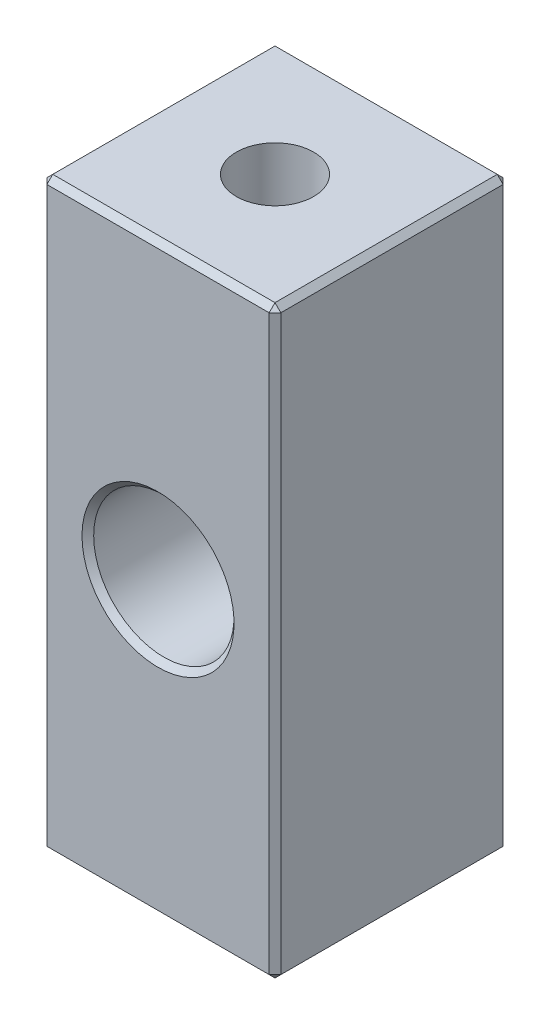
ISO-10303-21;
HEADER;
FILE_DESCRIPTION(('STEP AP214'),'2;1');
FILE_NAME('part.step','',(''),(''),'','','');
FILE_SCHEMA(('AUTOMOTIVE_DESIGN { 1 0 10303 214 1 1 1 1 }'));
ENDSEC;
DATA;
#1=APPLICATION_CONTEXT('core data for automotive mechanical design processes');
#2=APPLICATION_PROTOCOL_DEFINITION('international standard','automotive_design',2000,#1);
#3=PRODUCT_CONTEXT('',#1,'mechanical');
#4=PRODUCT('Part','Part','',(#3));
#5=PRODUCT_RELATED_PRODUCT_CATEGORY('part','',(#4));
#6=PRODUCT_DEFINITION_FORMATION('','',#4);
#7=PRODUCT_DEFINITION_CONTEXT('part definition',#1,'design');
#8=PRODUCT_DEFINITION('design','',#6,#7);
#9=PRODUCT_DEFINITION_SHAPE('','',#8);
#10=(LENGTH_UNIT() NAMED_UNIT(*) SI_UNIT(.MILLI.,.METRE.));
#11=(NAMED_UNIT(*) PLANE_ANGLE_UNIT() SI_UNIT($,.RADIAN.));
#12=(NAMED_UNIT(*) SI_UNIT($,.STERADIAN.) SOLID_ANGLE_UNIT());
#13=UNCERTAINTY_MEASURE_WITH_UNIT(LENGTH_MEASURE(1.E-05),#10,'distance_accuracy_value','');
#14=(GEOMETRIC_REPRESENTATION_CONTEXT(3) GLOBAL_UNCERTAINTY_ASSIGNED_CONTEXT((#13)) GLOBAL_UNIT_ASSIGNED_CONTEXT((#10,
#11,#12)) REPRESENTATION_CONTEXT('',''));
#15=CARTESIAN_POINT('',(0.,0.,0.));
#16=DIRECTION('',(0.,0.,1.));
#17=DIRECTION('',(1.,0.,0.));
#18=AXIS2_PLACEMENT_3D('',#15,#16,#17);
#19=CARTESIAN_POINT('',(-5.,-12.5,10.));
#20=DIRECTION('',(1.,0.,0.));
#21=DIRECTION('',(0.,0.,-1.));
#22=AXIS2_PLACEMENT_3D('',#19,#20,#21);
#23=PLANE('',#22);
#24=DIRECTION('',(0.,0.,-1.));
#25=VECTOR('',#24,1.);
#26=CARTESIAN_POINT('',(-5.,12.25,10.));
#27=LINE('',#26,#25);
#28=CARTESIAN_POINT('',(-5.,12.25,9.75));
#29=VERTEX_POINT('',#28);
#30=CARTESIAN_POINT('',(-5.,12.25,0.25));
#31=VERTEX_POINT('',#30);
#32=EDGE_CURVE('E169',#29,#31,#27,.T.);
#33=ORIENTED_EDGE('',*,*,#32,.T.);
#34=DIRECTION('',(0.,-1.,0.));
#35=VECTOR('',#34,1.);
#36=CARTESIAN_POINT('',(-5.,-12.5,0.25));
#37=LINE('',#36,#35);
#38=CARTESIAN_POINT('',(-5.,-12.25,0.25));
#39=VERTEX_POINT('',#38);
#40=EDGE_CURVE('E172',#31,#39,#37,.T.);
#41=ORIENTED_EDGE('',*,*,#40,.T.);
#42=DIRECTION('',(0.,0.,1.));
#43=VECTOR('',#42,1.);
#44=CARTESIAN_POINT('',(-5.,-12.25,10.));
#45=LINE('',#44,#43);
#46=CARTESIAN_POINT('',(-5.,-12.25,9.75));
#47=VERTEX_POINT('',#46);
#48=EDGE_CURVE('E167',#39,#47,#45,.T.);
#49=ORIENTED_EDGE('',*,*,#48,.T.);
#50=DIRECTION('',(0.,1.,0.));
#51=VECTOR('',#50,1.);
#52=CARTESIAN_POINT('',(-5.,-12.5,9.75));
#53=LINE('',#52,#51);
#54=EDGE_CURVE('E165',#47,#29,#53,.T.);
#55=ORIENTED_EDGE('',*,*,#54,.T.);
#56=EDGE_LOOP('',(#33,#41,#49,#55));
#57=FACE_BOUND('',#56,.T.);
#58=ADVANCED_FACE('F31',(#57),#23,.F.);
#59=CARTESIAN_POINT('',(-5.,-12.5,10.));
#60=DIRECTION('',(0.,1.,0.));
#61=DIRECTION('',(0.,0.,1.));
#62=AXIS2_PLACEMENT_3D('',#59,#60,#61);
#63=PLANE('',#62);
#64=DIRECTION('',(-1.,0.,0.));
#65=VECTOR('',#64,1.);
#66=CARTESIAN_POINT('',(-5.,-12.5,9.75));
#67=LINE('',#66,#65);
#68=CARTESIAN_POINT('',(4.75,-12.5,9.75));
#69=VERTEX_POINT('',#68);
#70=CARTESIAN_POINT('',(-4.75,-12.5,9.75));
#71=VERTEX_POINT('',#70);
#72=EDGE_CURVE('E183',#69,#71,#67,.T.);
#73=ORIENTED_EDGE('',*,*,#72,.T.);
#74=DIRECTION('',(0.,0.,-1.));
#75=VECTOR('',#74,1.);
#76=CARTESIAN_POINT('',(-4.75,-12.5,10.));
#77=LINE('',#76,#75);
#78=CARTESIAN_POINT('',(-4.75,-12.5,0.249999999999997));
#79=VERTEX_POINT('',#78);
#80=EDGE_CURVE('E189',#71,#79,#77,.T.);
#81=ORIENTED_EDGE('',*,*,#80,.T.);
#82=DIRECTION('',(1.,0.,0.));
#83=VECTOR('',#82,1.);
#84=CARTESIAN_POINT('',(5.,-12.5,0.249999999999997));
#85=LINE('',#84,#83);
#86=CARTESIAN_POINT('',(4.75,-12.5,0.249999999999997));
#87=VERTEX_POINT('',#86);
#88=EDGE_CURVE('E187',#79,#87,#85,.T.);
#89=ORIENTED_EDGE('',*,*,#88,.T.);
#90=DIRECTION('',(0.,0.,1.));
#91=VECTOR('',#90,1.);
#92=CARTESIAN_POINT('',(4.75,-12.5,10.));
#93=LINE('',#92,#91);
#94=EDGE_CURVE('E185',#87,#69,#93,.T.);
#95=ORIENTED_EDGE('',*,*,#94,.T.);
#96=EDGE_LOOP('',(#73,#81,#89,#95));
#97=FACE_BOUND('',#96,.T.);
#98=CARTESIAN_POINT('',(0.,-12.5,5.));
#99=DIRECTION('',(0.,-1.,0.));
#100=DIRECTION('',(0.,0.,-1.));
#101=AXIS2_PLACEMENT_3D('',#98,#99,#100);
#102=CIRCLE('',#101,1.64999999999999);
#103=CARTESIAN_POINT('',(0.,-12.5,3.35000000000001));
#104=VERTEX_POINT('',#103);
#105=EDGE_CURVE('E144',#104,#104,#102,.T.);
#106=ORIENTED_EDGE('',*,*,#105,.F.);
#107=EDGE_LOOP('',(#106));
#108=FACE_BOUND('',#107,.T.);
#109=ADVANCED_FACE('F317',(#97,#108),#63,.F.);
#110=CARTESIAN_POINT('',(5.,-12.5,10.));
#111=DIRECTION('',(-1.,0.,0.));
#112=DIRECTION('',(0.,0.,1.));
#113=AXIS2_PLACEMENT_3D('',#110,#111,#112);
#114=PLANE('',#113);
#115=DIRECTION('',(0.,-1.,0.));
#116=VECTOR('',#115,1.);
#117=CARTESIAN_POINT('',(5.,-12.5,9.75));
#118=LINE('',#117,#116);
#119=CARTESIAN_POINT('',(5.,12.25,9.75));
#120=VERTEX_POINT('',#119);
#121=CARTESIAN_POINT('',(5.,-12.25,9.75));
#122=VERTEX_POINT('',#121);
#123=EDGE_CURVE('E192',#120,#122,#118,.T.);
#124=ORIENTED_EDGE('',*,*,#123,.T.);
#125=DIRECTION('',(0.,0.,-1.));
#126=VECTOR('',#125,1.);
#127=CARTESIAN_POINT('',(5.,-12.25,10.));
#128=LINE('',#127,#126);
#129=CARTESIAN_POINT('',(5.,-12.25,0.249999999999997));
#130=VERTEX_POINT('',#129);
#131=EDGE_CURVE('E198',#122,#130,#128,.T.);
#132=ORIENTED_EDGE('',*,*,#131,.T.);
#133=DIRECTION('',(0.,1.,0.));
#134=VECTOR('',#133,1.);
#135=CARTESIAN_POINT('',(5.,12.5,0.249999999999997));
#136=LINE('',#135,#134);
#137=CARTESIAN_POINT('',(5.,12.25,0.249999999999997));
#138=VERTEX_POINT('',#137);
#139=EDGE_CURVE('E196',#130,#138,#136,.T.);
#140=ORIENTED_EDGE('',*,*,#139,.T.);
#141=DIRECTION('',(0.,0.,1.));
#142=VECTOR('',#141,1.);
#143=CARTESIAN_POINT('',(5.,12.25,10.));
#144=LINE('',#143,#142);
#145=EDGE_CURVE('E194',#138,#120,#144,.T.);
#146=ORIENTED_EDGE('',*,*,#145,.T.);
#147=EDGE_LOOP('',(#124,#132,#140,#146));
#148=FACE_BOUND('',#147,.T.);
#149=ADVANCED_FACE('F291',(#148),#114,.F.);
#150=CARTESIAN_POINT('',(-5.,12.5,10.));
#151=DIRECTION('',(0.,-1.,0.));
#152=DIRECTION('',(0.,0.,-1.));
#153=AXIS2_PLACEMENT_3D('',#150,#151,#152);
#154=PLANE('',#153);
#155=DIRECTION('',(-1.,0.,0.));
#156=VECTOR('',#155,1.);
#157=CARTESIAN_POINT('',(-5.,12.5,0.249999999999997));
#158=LINE('',#157,#156);
#159=CARTESIAN_POINT('',(4.75,12.5,0.249999999999997));
#160=VERTEX_POINT('',#159);
#161=CARTESIAN_POINT('',(-4.75,12.5,0.249999999999997));
#162=VERTEX_POINT('',#161);
#163=EDGE_CURVE('E178',#160,#162,#158,.T.);
#164=ORIENTED_EDGE('',*,*,#163,.T.);
#165=DIRECTION('',(0.,0.,1.));
#166=VECTOR('',#165,1.);
#167=CARTESIAN_POINT('',(-4.75,12.5,10.));
#168=LINE('',#167,#166);
#169=CARTESIAN_POINT('',(-4.75,12.5,9.75));
#170=VERTEX_POINT('',#169);
#171=EDGE_CURVE('E180',#162,#170,#168,.T.);
#172=ORIENTED_EDGE('',*,*,#171,.T.);
#173=DIRECTION('',(1.,0.,0.));
#174=VECTOR('',#173,1.);
#175=CARTESIAN_POINT('',(-5.,12.5,9.75));
#176=LINE('',#175,#174);
#177=CARTESIAN_POINT('',(4.75,12.5,9.75));
#178=VERTEX_POINT('',#177);
#179=EDGE_CURVE('E174',#170,#178,#176,.T.);
#180=ORIENTED_EDGE('',*,*,#179,.T.);
#181=DIRECTION('',(0.,0.,-1.));
#182=VECTOR('',#181,1.);
#183=CARTESIAN_POINT('',(4.75,12.5,10.));
#184=LINE('',#183,#182);
#185=EDGE_CURVE('E176',#178,#160,#184,.T.);
#186=ORIENTED_EDGE('',*,*,#185,.T.);
#187=EDGE_LOOP('',(#164,#172,#180,#186));
#188=FACE_BOUND('',#187,.T.);
#189=CARTESIAN_POINT('',(0.,12.5,5.));
#190=DIRECTION('',(0.,1.,0.));
#191=DIRECTION('',(0.,0.,1.));
#192=AXIS2_PLACEMENT_3D('',#189,#190,#191);
#193=CIRCLE('',#192,1.64999999999999);
#194=CARTESIAN_POINT('',(0.,12.5,6.64999999999999));
#195=VERTEX_POINT('',#194);
#196=EDGE_CURVE('E134',#195,#195,#193,.T.);
#197=ORIENTED_EDGE('',*,*,#196,.F.);
#198=EDGE_LOOP('',(#197));
#199=FACE_BOUND('',#198,.T.);
#200=ADVANCED_FACE('F345',(#188,#199),#154,.F.);
#201=CARTESIAN_POINT('',(-5.,12.5,10.));
#202=DIRECTION('',(0.,0.,-1.));
#203=DIRECTION('',(-1.,0.,0.));
#204=AXIS2_PLACEMENT_3D('',#201,#202,#203);
#205=PLANE('',#204);
#206=DIRECTION('',(0.,1.,0.));
#207=VECTOR('',#206,1.);
#208=CARTESIAN_POINT('',(4.75,12.5,10.));
#209=LINE('',#208,#207);
#210=CARTESIAN_POINT('',(4.75,-12.25,10.));
#211=VERTEX_POINT('',#210);
#212=CARTESIAN_POINT('',(4.75,12.25,10.));
#213=VERTEX_POINT('',#212);
#214=EDGE_CURVE('E40',#211,#213,#209,.T.);
#215=ORIENTED_EDGE('',*,*,#214,.T.);
#216=DIRECTION('',(-1.,0.,0.));
#217=VECTOR('',#216,1.);
#218=CARTESIAN_POINT('',(-5.,12.25,10.));
#219=LINE('',#218,#217);
#220=CARTESIAN_POINT('',(-4.75,12.25,10.));
#221=VERTEX_POINT('',#220);
#222=EDGE_CURVE('E11',#213,#221,#219,.T.);
#223=ORIENTED_EDGE('',*,*,#222,.T.);
#224=DIRECTION('',(0.,-1.,0.));
#225=VECTOR('',#224,1.);
#226=CARTESIAN_POINT('',(-4.75,12.5,10.));
#227=LINE('',#226,#225);
#228=CARTESIAN_POINT('',(-4.75,-12.25,10.));
#229=VERTEX_POINT('',#228);
#230=EDGE_CURVE('E204',#221,#229,#227,.T.);
#231=ORIENTED_EDGE('',*,*,#230,.T.);
#232=DIRECTION('',(1.,0.,0.));
#233=VECTOR('',#232,1.);
#234=CARTESIAN_POINT('',(-5.,-12.25,10.));
#235=LINE('',#234,#233);
#236=EDGE_CURVE('E51',#229,#211,#235,.T.);
#237=ORIENTED_EDGE('',*,*,#236,.T.);
#238=EDGE_LOOP('',(#215,#223,#231,#237));
#239=FACE_BOUND('',#238,.T.);
#240=CARTESIAN_POINT('',(0.,0.,10.));
#241=DIRECTION('',(0.,0.,-1.));
#242=DIRECTION('',(-1.,0.,0.));
#243=AXIS2_PLACEMENT_3D('',#240,#241,#242);
#244=CIRCLE('',#243,3.25);
#245=CARTESIAN_POINT('',(-3.25,0.,10.));
#246=VERTEX_POINT('',#245);
#247=EDGE_CURVE('E201',#246,#246,#244,.T.);
#248=ORIENTED_EDGE('',*,*,#247,.T.);
#249=EDGE_LOOP('',(#248));
#250=FACE_BOUND('',#249,.T.);
#251=ADVANCED_FACE('F352',(#239,#250),#205,.F.);
#252=CARTESIAN_POINT('',(-5.,12.5,0.));
#253=DIRECTION('',(0.,0.,-1.));
#254=DIRECTION('',(-1.,0.,0.));
#255=AXIS2_PLACEMENT_3D('',#252,#253,#254);
#256=PLANE('',#255);
#257=CARTESIAN_POINT('',(0.,0.,0.));
#258=DIRECTION('',(0.,0.,-1.));
#259=DIRECTION('',(-1.,0.,0.));
#260=AXIS2_PLACEMENT_3D('',#257,#258,#259);
#261=CIRCLE('',#260,3.25);
#262=CARTESIAN_POINT('',(-3.25,0.,0.));
#263=VERTEX_POINT('',#262);
#264=EDGE_CURVE('E156',#263,#263,#261,.F.);
#265=ORIENTED_EDGE('',*,*,#264,.T.);
#266=EDGE_LOOP('',(#265));
#267=FACE_BOUND('',#266,.T.);
#268=DIRECTION('',(0.,-1.,0.));
#269=VECTOR('',#268,1.);
#270=CARTESIAN_POINT('',(4.75,-12.5,0.));
#271=LINE('',#270,#269);
#272=CARTESIAN_POINT('',(4.75,12.25,0.));
#273=VERTEX_POINT('',#272);
#274=CARTESIAN_POINT('',(4.75,-12.25,0.));
#275=VERTEX_POINT('',#274);
#276=EDGE_CURVE('E147',#273,#275,#271,.T.);
#277=ORIENTED_EDGE('',*,*,#276,.T.);
#278=DIRECTION('',(-1.,0.,0.));
#279=VECTOR('',#278,1.);
#280=CARTESIAN_POINT('',(-5.,-12.25,0.));
#281=LINE('',#280,#279);
#282=CARTESIAN_POINT('',(-4.75,-12.25,0.));
#283=VERTEX_POINT('',#282);
#284=EDGE_CURVE('E153',#275,#283,#281,.T.);
#285=ORIENTED_EDGE('',*,*,#284,.T.);
#286=DIRECTION('',(0.,1.,0.));
#287=VECTOR('',#286,1.);
#288=CARTESIAN_POINT('',(-4.75,12.5,0.));
#289=LINE('',#288,#287);
#290=CARTESIAN_POINT('',(-4.75,12.25,0.));
#291=VERTEX_POINT('',#290);
#292=EDGE_CURVE('E151',#283,#291,#289,.T.);
#293=ORIENTED_EDGE('',*,*,#292,.T.);
#294=DIRECTION('',(1.,0.,0.));
#295=VECTOR('',#294,1.);
#296=CARTESIAN_POINT('',(5.,12.25,0.));
#297=LINE('',#296,#295);
#298=EDGE_CURVE('E149',#291,#273,#297,.T.);
#299=ORIENTED_EDGE('',*,*,#298,.T.);
#300=EDGE_LOOP('',(#277,#285,#293,#299));
#301=FACE_BOUND('',#300,.T.);
#302=ADVANCED_FACE('F283',(#267,#301),#256,.T.);
#303=CARTESIAN_POINT('',(0.,0.,0.));
#304=DIRECTION('',(0.,0.,1.));
#305=DIRECTION('',(1.,0.,0.));
#306=AXIS2_PLACEMENT_3D('',#303,#304,#305);
#307=CYLINDRICAL_SURFACE('',#306,3.);
#308=CARTESIAN_POINT('',(0.,0.,0.250000000000002));
#309=DIRECTION('',(0.,0.,-1.));
#310=DIRECTION('',(-1.,0.,0.));
#311=AXIS2_PLACEMENT_3D('',#308,#309,#310);
#312=CIRCLE('',#311,3.);
#313=CARTESIAN_POINT('',(-3.,0.,0.250000000000002));
#314=VERTEX_POINT('',#313);
#315=EDGE_CURVE('E162',#314,#314,#312,.T.);
#316=ORIENTED_EDGE('',*,*,#315,.T.);
#317=EDGE_LOOP('',(#316));
#318=FACE_BOUND('',#317,.T.);
#319=CARTESIAN_POINT('',(0.,0.,9.75));
#320=DIRECTION('',(0.,0.,-1.));
#321=DIRECTION('',(-1.,0.,0.));
#322=AXIS2_PLACEMENT_3D('',#319,#320,#321);
#323=CIRCLE('',#322,3.);
#324=CARTESIAN_POINT('',(-3.,0.,9.75));
#325=VERTEX_POINT('',#324);
#326=EDGE_CURVE('E159',#325,#325,#323,.F.);
#327=ORIENTED_EDGE('',*,*,#326,.T.);
#328=EDGE_LOOP('',(#327));
#329=FACE_BOUND('',#328,.T.);
#330=ADVANCED_FACE('F577',(#318,#329),#307,.F.);
#331=CARTESIAN_POINT('',(0.,-12.5,5.));
#332=DIRECTION('',(0.,-1.,0.));
#333=DIRECTION('',(0.,0.,-1.));
#334=AXIS2_PLACEMENT_3D('',#331,#332,#333);
#335=CYLINDRICAL_SURFACE('',#334,1.64999999999999);
#336=CARTESIAN_POINT('',(0.,-4.5,5.));
#337=DIRECTION('',(0.,-1.,0.));
#338=DIRECTION('',(0.,0.,-1.));
#339=AXIS2_PLACEMENT_3D('',#336,#337,#338);
#340=CIRCLE('',#339,1.65);
#341=CARTESIAN_POINT('',(0.,-4.5,3.35));
#342=VERTEX_POINT('',#341);
#343=EDGE_CURVE('E137',#342,#342,#340,.T.);
#344=ORIENTED_EDGE('',*,*,#343,.F.);
#345=EDGE_LOOP('',(#344));
#346=FACE_BOUND('',#345,.T.);
#347=ORIENTED_EDGE('',*,*,#105,.T.);
#348=EDGE_LOOP('',(#347));
#349=FACE_BOUND('',#348,.T.);
#350=ADVANCED_FACE('F568',(#346,#349),#335,.F.);
#351=CARTESIAN_POINT('',(0.,-4.5,5.));
#352=DIRECTION('',(0.,-1.,0.));
#353=DIRECTION('',(0.,0.,-1.));
#354=AXIS2_PLACEMENT_3D('',#351,#352,#353);
#355=CONICAL_SURFACE('',#354,1.65,1.02974425867665);
#356=CARTESIAN_POINT('',(0.,-3.50857997860453,5.));
#357=VERTEX_POINT('',#356);
#358=VERTEX_LOOP('',#357);
#359=FACE_BOUND('',#358,.T.);
#360=ORIENTED_EDGE('',*,*,#343,.T.);
#361=EDGE_LOOP('',(#360));
#362=FACE_BOUND('',#361,.T.);
#363=ADVANCED_FACE('F560',(#359,#362),#355,.F.);
#364=CARTESIAN_POINT('',(0.,12.5,5.));
#365=DIRECTION('',(0.,1.,0.));
#366=DIRECTION('',(0.,0.,1.));
#367=AXIS2_PLACEMENT_3D('',#364,#365,#366);
#368=CYLINDRICAL_SURFACE('',#367,1.64999999999999);
#369=CARTESIAN_POINT('',(0.,4.5,5.));
#370=DIRECTION('',(0.,1.,0.));
#371=DIRECTION('',(0.,0.,1.));
#372=AXIS2_PLACEMENT_3D('',#369,#370,#371);
#373=CIRCLE('',#372,1.65);
#374=CARTESIAN_POINT('',(0.,4.5,6.65));
#375=VERTEX_POINT('',#374);
#376=EDGE_CURVE('E132',#375,#375,#373,.T.);
#377=ORIENTED_EDGE('',*,*,#376,.F.);
#378=EDGE_LOOP('',(#377));
#379=FACE_BOUND('',#378,.T.);
#380=ORIENTED_EDGE('',*,*,#196,.T.);
#381=EDGE_LOOP('',(#380));
#382=FACE_BOUND('',#381,.T.);
#383=ADVANCED_FACE('F128',(#379,#382),#368,.F.);
#384=CARTESIAN_POINT('',(0.,4.5,5.));
#385=DIRECTION('',(0.,1.,0.));
#386=DIRECTION('',(0.,0.,1.));
#387=AXIS2_PLACEMENT_3D('',#384,#385,#386);
#388=CONICAL_SURFACE('',#387,1.65,1.02974425867665);
#389=CARTESIAN_POINT('',(0.,3.50857997860453,5.));
#390=VERTEX_POINT('',#389);
#391=VERTEX_LOOP('',#390);
#392=FACE_BOUND('',#391,.T.);
#393=ORIENTED_EDGE('',*,*,#376,.T.);
#394=EDGE_LOOP('',(#393));
#395=FACE_BOUND('',#394,.T.);
#396=ADVANCED_FACE('F124',(#392,#395),#388,.F.);
#397=CARTESIAN_POINT('',(0.,0.,0.));
#398=DIRECTION('',(0.,0.,-1.));
#399=DIRECTION('',(-1.,0.,0.));
#400=AXIS2_PLACEMENT_3D('',#397,#398,#399);
#401=CONICAL_SURFACE('',#400,3.25,0.785398163397448);
#402=ORIENTED_EDGE('',*,*,#315,.F.);
#403=EDGE_LOOP('',(#402));
#404=FACE_BOUND('',#403,.T.);
#405=ORIENTED_EDGE('',*,*,#264,.F.);
#406=EDGE_LOOP('',(#405));
#407=FACE_BOUND('',#406,.T.);
#408=ADVANCED_FACE('F127',(#404,#407),#401,.F.);
#409=CARTESIAN_POINT('',(5.,-12.25,10.));
#410=DIRECTION('',(-0.707106781186543,0.707106781186552,0.));
#411=DIRECTION('',(-0.707106781186552,-0.707106781186543,0.));
#412=AXIS2_PLACEMENT_3D('',#409,#410,#411);
#413=PLANE('',#412);
#414=DIRECTION('',(-0.707106781186552,-0.707106781186543,0.));
#415=VECTOR('',#414,1.);
#416=CARTESIAN_POINT('',(4.75,-12.5,9.75));
#417=LINE('',#416,#415);
#418=EDGE_CURVE('E35',#69,#122,#417,.F.);
#419=ORIENTED_EDGE('',*,*,#418,.F.);
#420=ORIENTED_EDGE('',*,*,#94,.F.);
#421=DIRECTION('',(0.707106781186552,0.707106781186543,0.));
#422=VECTOR('',#421,1.);
#423=CARTESIAN_POINT('',(4.75,-12.5,0.249999999999997));
#424=LINE('',#423,#422);
#425=EDGE_CURVE('E140',#130,#87,#424,.F.);
#426=ORIENTED_EDGE('',*,*,#425,.F.);
#427=ORIENTED_EDGE('',*,*,#131,.F.);
#428=EDGE_LOOP('',(#419,#420,#426,#427));
#429=FACE_BOUND('',#428,.T.);
#430=ADVANCED_FACE('F307',(#429),#413,.F.);
#431=CARTESIAN_POINT('',(4.75,-12.5,9.75));
#432=DIRECTION('',(0.577350269189626,-0.577350269189634,0.577350269189618));
#433=DIRECTION('',(0.707106781186552,0.707106781186543,0.));
#434=AXIS2_PLACEMENT_3D('',#431,#432,#433);
#435=PLANE('',#434);
#436=DIRECTION('',(0.,0.707106781186543,0.707106781186552));
#437=VECTOR('',#436,1.);
#438=CARTESIAN_POINT('',(4.75,-12.5,9.75));
#439=LINE('',#438,#437);
#440=EDGE_CURVE('E264',#69,#211,#439,.T.);
#441=ORIENTED_EDGE('',*,*,#440,.F.);
#442=ORIENTED_EDGE('',*,*,#418,.T.);
#443=DIRECTION('',(0.707106781186543,0.,-0.707106781186552));
#444=VECTOR('',#443,1.);
#445=CARTESIAN_POINT('',(4.875,-12.25,9.875));
#446=LINE('',#445,#444);
#447=EDGE_CURVE('E266',#211,#122,#446,.T.);
#448=ORIENTED_EDGE('',*,*,#447,.F.);
#449=EDGE_LOOP('',(#441,#442,#448));
#450=FACE_BOUND('',#449,.T.);
#451=ADVANCED_FACE('F310',(#450),#435,.T.);
#452=CARTESIAN_POINT('',(4.75,-12.5,0.249999999999997));
#453=DIRECTION('',(0.577350269189618,-0.577350269189626,-0.577350269189634));
#454=DIRECTION('',(0.,0.707106781186552,-0.707106781186543));
#455=AXIS2_PLACEMENT_3D('',#452,#453,#454);
#456=PLANE('',#455);
#457=DIRECTION('',(0.707106781186552,0.,0.707106781186543));
#458=VECTOR('',#457,1.);
#459=CARTESIAN_POINT('',(4.875,-12.25,0.124999999999998));
#460=LINE('',#459,#458);
#461=EDGE_CURVE('E258',#130,#275,#460,.F.);
#462=ORIENTED_EDGE('',*,*,#461,.F.);
#463=ORIENTED_EDGE('',*,*,#425,.T.);
#464=DIRECTION('',(0.,0.707106781186552,-0.707106781186543));
#465=VECTOR('',#464,1.);
#466=CARTESIAN_POINT('',(4.75,-12.5,0.249999999999997));
#467=LINE('',#466,#465);
#468=EDGE_CURVE('E261',#275,#87,#467,.F.);
#469=ORIENTED_EDGE('',*,*,#468,.F.);
#470=EDGE_LOOP('',(#462,#463,#469));
#471=FACE_BOUND('',#470,.T.);
#472=ADVANCED_FACE('F273',(#471),#456,.T.);
#473=CARTESIAN_POINT('',(4.75,12.5,10.));
#474=DIRECTION('',(-0.707106781186552,0.,-0.707106781186543));
#475=DIRECTION('',(-0.707106781186543,0.,0.707106781186552));
#476=AXIS2_PLACEMENT_3D('',#473,#474,#475);
#477=PLANE('',#476);
#478=ORIENTED_EDGE('',*,*,#447,.T.);
#479=ORIENTED_EDGE('',*,*,#123,.F.);
#480=DIRECTION('',(-0.707106781186543,0.,0.707106781186552));
#481=VECTOR('',#480,1.);
#482=CARTESIAN_POINT('',(5.,12.25,9.75));
#483=LINE('',#482,#481);
#484=EDGE_CURVE('E252',#213,#120,#483,.F.);
#485=ORIENTED_EDGE('',*,*,#484,.F.);
#486=ORIENTED_EDGE('',*,*,#214,.F.);
#487=EDGE_LOOP('',(#478,#479,#485,#486));
#488=FACE_BOUND('',#487,.T.);
#489=ADVANCED_FACE('F304',(#488),#477,.F.);
#490=CARTESIAN_POINT('',(-5.,-12.25,10.));
#491=DIRECTION('',(0.,0.707106781186552,-0.707106781186543));
#492=DIRECTION('',(0.,0.707106781186543,0.707106781186552));
#493=AXIS2_PLACEMENT_3D('',#490,#491,#492);
#494=PLANE('',#493);
#495=ORIENTED_EDGE('',*,*,#440,.T.);
#496=ORIENTED_EDGE('',*,*,#236,.F.);
#497=DIRECTION('',(0.,-0.707106781186543,-0.707106781186552));
#498=VECTOR('',#497,1.);
#499=CARTESIAN_POINT('',(-4.75,-12.375,9.875));
#500=LINE('',#499,#498);
#501=EDGE_CURVE('E249',#71,#229,#500,.F.);
#502=ORIENTED_EDGE('',*,*,#501,.F.);
#503=ORIENTED_EDGE('',*,*,#72,.F.);
#504=EDGE_LOOP('',(#495,#496,#502,#503));
#505=FACE_BOUND('',#504,.T.);
#506=ADVANCED_FACE('F314',(#505),#494,.F.);
#507=CARTESIAN_POINT('',(-4.75,-12.5,10.));
#508=DIRECTION('',(0.707106781186552,0.707106781186543,0.));
#509=DIRECTION('',(-0.707106781186543,0.707106781186552,0.));
#510=AXIS2_PLACEMENT_3D('',#507,#508,#509);
#511=PLANE('',#510);
#512=DIRECTION('',(0.707106781186543,-0.707106781186552,0.));
#513=VECTOR('',#512,1.);
#514=CARTESIAN_POINT('',(-4.75,-12.5,0.249999999999997));
#515=LINE('',#514,#513);
#516=EDGE_CURVE('E243',#79,#39,#515,.F.);
#517=ORIENTED_EDGE('',*,*,#516,.F.);
#518=ORIENTED_EDGE('',*,*,#80,.F.);
#519=DIRECTION('',(-0.707106781186543,0.707106781186552,0.));
#520=VECTOR('',#519,1.);
#521=CARTESIAN_POINT('',(-5.,-12.25,9.75));
#522=LINE('',#521,#520);
#523=EDGE_CURVE('E246',#47,#71,#522,.F.);
#524=ORIENTED_EDGE('',*,*,#523,.F.);
#525=ORIENTED_EDGE('',*,*,#48,.F.);
#526=EDGE_LOOP('',(#517,#518,#524,#525));
#527=FACE_BOUND('',#526,.T.);
#528=ADVANCED_FACE('F322',(#527),#511,.F.);
#529=CARTESIAN_POINT('',(-5.,-12.5,0.249999999999997));
#530=DIRECTION('',(0.,-0.707106781186543,-0.707106781186552));
#531=DIRECTION('',(0.,0.707106781186552,-0.707106781186543));
#532=AXIS2_PLACEMENT_3D('',#529,#530,#531);
#533=PLANE('',#532);
#534=ORIENTED_EDGE('',*,*,#468,.T.);
#535=ORIENTED_EDGE('',*,*,#88,.F.);
#536=DIRECTION('',(0.,-0.707106781186552,0.707106781186543));
#537=VECTOR('',#536,1.);
#538=CARTESIAN_POINT('',(-4.75,-12.5,0.249999999999997));
#539=LINE('',#538,#537);
#540=EDGE_CURVE('E241',#283,#79,#539,.T.);
#541=ORIENTED_EDGE('',*,*,#540,.F.);
#542=ORIENTED_EDGE('',*,*,#284,.F.);
#543=EDGE_LOOP('',(#534,#535,#541,#542));
#544=FACE_BOUND('',#543,.T.);
#545=ADVANCED_FACE('F280',(#544),#533,.T.);
#546=CARTESIAN_POINT('',(5.,-12.5,0.249999999999997));
#547=DIRECTION('',(0.707106781186543,0.,-0.707106781186552));
#548=DIRECTION('',(-0.707106781186552,0.,-0.707106781186543));
#549=AXIS2_PLACEMENT_3D('',#546,#547,#548);
#550=PLANE('',#549);
#551=ORIENTED_EDGE('',*,*,#461,.T.);
#552=ORIENTED_EDGE('',*,*,#276,.F.);
#553=DIRECTION('',(-0.707106781186552,0.,-0.707106781186543));
#554=VECTOR('',#553,1.);
#555=CARTESIAN_POINT('',(4.75,12.25,0.));
#556=LINE('',#555,#554);
#557=EDGE_CURVE('E238',#138,#273,#556,.T.);
#558=ORIENTED_EDGE('',*,*,#557,.F.);
#559=ORIENTED_EDGE('',*,*,#139,.F.);
#560=EDGE_LOOP('',(#551,#552,#558,#559));
#561=FACE_BOUND('',#560,.T.);
#562=ADVANCED_FACE('F288',(#561),#550,.T.);
#563=CARTESIAN_POINT('',(4.75,12.5,10.));
#564=DIRECTION('',(-0.707106781186552,-0.707106781186543,0.));
#565=DIRECTION('',(0.707106781186543,-0.707106781186552,0.));
#566=AXIS2_PLACEMENT_3D('',#563,#564,#565);
#567=PLANE('',#566);
#568=DIRECTION('',(0.707106781186543,-0.707106781186552,0.));
#569=VECTOR('',#568,1.);
#570=CARTESIAN_POINT('',(5.,12.25,9.75));
#571=LINE('',#570,#569);
#572=EDGE_CURVE('E255',#120,#178,#571,.F.);
#573=ORIENTED_EDGE('',*,*,#572,.F.);
#574=ORIENTED_EDGE('',*,*,#145,.F.);
#575=DIRECTION('',(-0.707106781186543,0.707106781186552,0.));
#576=VECTOR('',#575,1.);
#577=CARTESIAN_POINT('',(4.875,12.375,0.249999999999997));
#578=LINE('',#577,#576);
#579=EDGE_CURVE('E235',#160,#138,#578,.F.);
#580=ORIENTED_EDGE('',*,*,#579,.F.);
#581=ORIENTED_EDGE('',*,*,#185,.F.);
#582=EDGE_LOOP('',(#573,#574,#580,#581));
#583=FACE_BOUND('',#582,.T.);
#584=ADVANCED_FACE('F296',(#583),#567,.F.);
#585=CARTESIAN_POINT('',(5.,12.25,9.75));
#586=DIRECTION('',(0.577350269189634,0.577350269189626,0.577350269189618));
#587=DIRECTION('',(-0.707106781186543,0.707106781186552,0.));
#588=AXIS2_PLACEMENT_3D('',#585,#586,#587);
#589=PLANE('',#588);
#590=ORIENTED_EDGE('',*,*,#484,.T.);
#591=ORIENTED_EDGE('',*,*,#572,.T.);
#592=DIRECTION('',(0.,0.707106781186543,-0.707106781186552));
#593=VECTOR('',#592,1.);
#594=CARTESIAN_POINT('',(4.75,12.375,9.875));
#595=LINE('',#594,#593);
#596=EDGE_CURVE('E232',#213,#178,#595,.T.);
#597=ORIENTED_EDGE('',*,*,#596,.F.);
#598=EDGE_LOOP('',(#590,#591,#597));
#599=FACE_BOUND('',#598,.T.);
#600=ADVANCED_FACE('F301',(#599),#589,.T.);
#601=CARTESIAN_POINT('',(-5.,-12.25,9.75));
#602=DIRECTION('',(-0.577350269189634,-0.577350269189626,0.577350269189618));
#603=DIRECTION('',(0.707106781186543,-0.707106781186552,0.));
#604=AXIS2_PLACEMENT_3D('',#601,#602,#603);
#605=PLANE('',#604);
#606=ORIENTED_EDGE('',*,*,#523,.T.);
#607=ORIENTED_EDGE('',*,*,#501,.T.);
#608=DIRECTION('',(0.707106781186543,0.,0.707106781186552));
#609=VECTOR('',#608,1.);
#610=CARTESIAN_POINT('',(-5.,-12.25,9.75));
#611=LINE('',#610,#609);
#612=EDGE_CURVE('E229',#47,#229,#611,.T.);
#613=ORIENTED_EDGE('',*,*,#612,.F.);
#614=EDGE_LOOP('',(#606,#607,#613));
#615=FACE_BOUND('',#614,.T.);
#616=ADVANCED_FACE('F357',(#615),#605,.T.);
#617=CARTESIAN_POINT('',(-4.75,-12.5,0.249999999999997));
#618=DIRECTION('',(-0.577350269189634,-0.577350269189618,-0.577350269189626));
#619=DIRECTION('',(-0.707106781186543,0.,0.707106781186552));
#620=AXIS2_PLACEMENT_3D('',#617,#618,#619);
#621=PLANE('',#620);
#622=ORIENTED_EDGE('',*,*,#540,.T.);
#623=ORIENTED_EDGE('',*,*,#516,.T.);
#624=DIRECTION('',(0.707106781186543,0.,-0.707106781186552));
#625=VECTOR('',#624,1.);
#626=CARTESIAN_POINT('',(-4.875,-12.25,0.125));
#627=LINE('',#626,#625);
#628=EDGE_CURVE('E226',#283,#39,#627,.F.);
#629=ORIENTED_EDGE('',*,*,#628,.F.);
#630=EDGE_LOOP('',(#622,#623,#629));
#631=FACE_BOUND('',#630,.T.);
#632=ADVANCED_FACE('F327',(#631),#621,.T.);
#633=CARTESIAN_POINT('',(4.75,12.25,0.));
#634=DIRECTION('',(0.577350269189626,0.577350269189618,-0.577350269189634));
#635=DIRECTION('',(-0.707106781186552,0.,-0.707106781186543));
#636=AXIS2_PLACEMENT_3D('',#633,#634,#635);
#637=PLANE('',#636);
#638=ORIENTED_EDGE('',*,*,#579,.T.);
#639=ORIENTED_EDGE('',*,*,#557,.T.);
#640=DIRECTION('',(0.,0.707106781186552,0.707106781186543));
#641=VECTOR('',#640,1.);
#642=CARTESIAN_POINT('',(4.75,12.25,0.));
#643=LINE('',#642,#641);
#644=EDGE_CURVE('E223',#160,#273,#643,.F.);
#645=ORIENTED_EDGE('',*,*,#644,.F.);
#646=EDGE_LOOP('',(#638,#639,#645));
#647=FACE_BOUND('',#646,.T.);
#648=ADVANCED_FACE('F388',(#647),#637,.T.);
#649=CARTESIAN_POINT('',(-5.,12.25,10.));
#650=DIRECTION('',(0.,-0.707106781186552,-0.707106781186543));
#651=DIRECTION('',(0.,0.707106781186543,-0.707106781186552));
#652=AXIS2_PLACEMENT_3D('',#649,#650,#651);
#653=PLANE('',#652);
#654=ORIENTED_EDGE('',*,*,#596,.T.);
#655=ORIENTED_EDGE('',*,*,#179,.F.);
#656=DIRECTION('',(0.,-0.707106781186543,0.707106781186552));
#657=VECTOR('',#656,1.);
#658=CARTESIAN_POINT('',(-4.75,12.5,9.75));
#659=LINE('',#658,#657);
#660=EDGE_CURVE('E220',#221,#170,#659,.F.);
#661=ORIENTED_EDGE('',*,*,#660,.F.);
#662=ORIENTED_EDGE('',*,*,#222,.F.);
#663=EDGE_LOOP('',(#654,#655,#661,#662));
#664=FACE_BOUND('',#663,.T.);
#665=ADVANCED_FACE('F350',(#664),#653,.F.);
#666=CARTESIAN_POINT('',(-4.75,12.5,10.));
#667=DIRECTION('',(0.707106781186552,0.,-0.707106781186543));
#668=DIRECTION('',(-0.707106781186543,0.,-0.707106781186552));
#669=AXIS2_PLACEMENT_3D('',#666,#667,#668);
#670=PLANE('',#669);
#671=ORIENTED_EDGE('',*,*,#612,.T.);
#672=ORIENTED_EDGE('',*,*,#230,.F.);
#673=DIRECTION('',(-0.707106781186543,0.,-0.707106781186552));
#674=VECTOR('',#673,1.);
#675=CARTESIAN_POINT('',(-4.875,12.25,9.875));
#676=LINE('',#675,#674);
#677=EDGE_CURVE('E218',#29,#221,#676,.F.);
#678=ORIENTED_EDGE('',*,*,#677,.F.);
#679=ORIENTED_EDGE('',*,*,#54,.F.);
#680=EDGE_LOOP('',(#671,#672,#678,#679));
#681=FACE_BOUND('',#680,.T.);
#682=ADVANCED_FACE('F359',(#681),#670,.F.);
#683=CARTESIAN_POINT('',(-5.,-12.5,0.25));
#684=DIRECTION('',(-0.707106781186552,0.,-0.707106781186543));
#685=DIRECTION('',(-0.707106781186543,0.,0.707106781186552));
#686=AXIS2_PLACEMENT_3D('',#683,#684,#685);
#687=PLANE('',#686);
#688=ORIENTED_EDGE('',*,*,#628,.T.);
#689=ORIENTED_EDGE('',*,*,#40,.F.);
#690=DIRECTION('',(-0.707106781186543,0.,0.707106781186552));
#691=VECTOR('',#690,1.);
#692=CARTESIAN_POINT('',(-5.,12.25,0.25));
#693=LINE('',#692,#691);
#694=EDGE_CURVE('E215',#291,#31,#693,.T.);
#695=ORIENTED_EDGE('',*,*,#694,.F.);
#696=ORIENTED_EDGE('',*,*,#292,.F.);
#697=EDGE_LOOP('',(#688,#689,#695,#696));
#698=FACE_BOUND('',#697,.T.);
#699=ADVANCED_FACE('F330',(#698),#687,.T.);
#700=CARTESIAN_POINT('',(-5.,12.5,0.249999999999997));
#701=DIRECTION('',(0.,0.707106781186543,-0.707106781186552));
#702=DIRECTION('',(0.,0.707106781186552,0.707106781186543));
#703=AXIS2_PLACEMENT_3D('',#700,#701,#702);
#704=PLANE('',#703);
#705=ORIENTED_EDGE('',*,*,#644,.T.);
#706=ORIENTED_EDGE('',*,*,#298,.F.);
#707=DIRECTION('',(0.,-0.707106781186552,-0.707106781186543));
#708=VECTOR('',#707,1.);
#709=CARTESIAN_POINT('',(-4.75,12.375,0.124999999999998));
#710=LINE('',#709,#708);
#711=EDGE_CURVE('E212',#162,#291,#710,.T.);
#712=ORIENTED_EDGE('',*,*,#711,.F.);
#713=ORIENTED_EDGE('',*,*,#163,.F.);
#714=EDGE_LOOP('',(#705,#706,#712,#713));
#715=FACE_BOUND('',#714,.T.);
#716=ADVANCED_FACE('F339',(#715),#704,.T.);
#717=CARTESIAN_POINT('',(-4.75,12.5,9.75));
#718=DIRECTION('',(-0.577350269189634,0.577350269189626,0.577350269189618));
#719=DIRECTION('',(-0.707106781186543,-0.707106781186552,0.));
#720=AXIS2_PLACEMENT_3D('',#717,#718,#719);
#721=PLANE('',#720);
#722=ORIENTED_EDGE('',*,*,#677,.T.);
#723=ORIENTED_EDGE('',*,*,#660,.T.);
#724=DIRECTION('',(0.707106781186543,0.707106781186552,0.));
#725=VECTOR('',#724,1.);
#726=CARTESIAN_POINT('',(-4.75,12.5,9.75));
#727=LINE('',#726,#725);
#728=EDGE_CURVE('E210',#29,#170,#727,.T.);
#729=ORIENTED_EDGE('',*,*,#728,.F.);
#730=EDGE_LOOP('',(#722,#723,#729));
#731=FACE_BOUND('',#730,.T.);
#732=ADVANCED_FACE('F376',(#731),#721,.T.);
#733=CARTESIAN_POINT('',(-5.,12.25,0.25));
#734=DIRECTION('',(-0.577350269189634,0.577350269189618,-0.577350269189626));
#735=DIRECTION('',(-0.707106781186543,0.,0.707106781186552));
#736=AXIS2_PLACEMENT_3D('',#733,#734,#735);
#737=PLANE('',#736);
#738=ORIENTED_EDGE('',*,*,#711,.T.);
#739=ORIENTED_EDGE('',*,*,#694,.T.);
#740=DIRECTION('',(-0.707106781186543,-0.707106781186552,0.));
#741=VECTOR('',#740,1.);
#742=CARTESIAN_POINT('',(-5.,12.25,0.25));
#743=LINE('',#742,#741);
#744=EDGE_CURVE('E208',#162,#31,#743,.T.);
#745=ORIENTED_EDGE('',*,*,#744,.F.);
#746=EDGE_LOOP('',(#738,#739,#745));
#747=FACE_BOUND('',#746,.T.);
#748=ADVANCED_FACE('F335',(#747),#737,.T.);
#749=CARTESIAN_POINT('',(-5.,12.25,10.));
#750=DIRECTION('',(0.707106781186552,-0.707106781186543,0.));
#751=DIRECTION('',(0.707106781186543,0.707106781186552,0.));
#752=AXIS2_PLACEMENT_3D('',#749,#750,#751);
#753=PLANE('',#752);
#754=ORIENTED_EDGE('',*,*,#728,.T.);
#755=ORIENTED_EDGE('',*,*,#171,.F.);
#756=ORIENTED_EDGE('',*,*,#744,.T.);
#757=ORIENTED_EDGE('',*,*,#32,.F.);
#758=EDGE_LOOP('',(#754,#755,#756,#757));
#759=FACE_BOUND('',#758,.T.);
#760=ADVANCED_FACE('F341',(#759),#753,.F.);
#761=CARTESIAN_POINT('',(0.,0.,9.75));
#762=DIRECTION('',(0.,0.,1.));
#763=DIRECTION('',(1.,0.,0.));
#764=AXIS2_PLACEMENT_3D('',#761,#762,#763);
#765=CONICAL_SURFACE('',#764,3.,0.78539816339745);
#766=ORIENTED_EDGE('',*,*,#247,.F.);
#767=EDGE_LOOP('',(#766));
#768=FACE_BOUND('',#767,.T.);
#769=ORIENTED_EDGE('',*,*,#326,.F.);
#770=EDGE_LOOP('',(#769));
#771=FACE_BOUND('',#770,.T.);
#772=ADVANCED_FACE('F33',(#768,#771),#765,.F.);
#773=CLOSED_SHELL('',(#58,#109,#149,#200,#251,#302,#330,#350,#363,#383,#396,#408,#430,#451,#472,
#489,#506,#528,#545,#562,#584,#600,#616,#632,#648,#665,#682,#699,#716,#732,#748,#760,#772));
#774=MANIFOLD_SOLID_BREP('B2',#773);
#775=ADVANCED_BREP_SHAPE_REPRESENTATION('',(#18,#774),#14);
#776=SHAPE_DEFINITION_REPRESENTATION(#9,#775);
ENDSEC;
END-ISO-10303-21;
